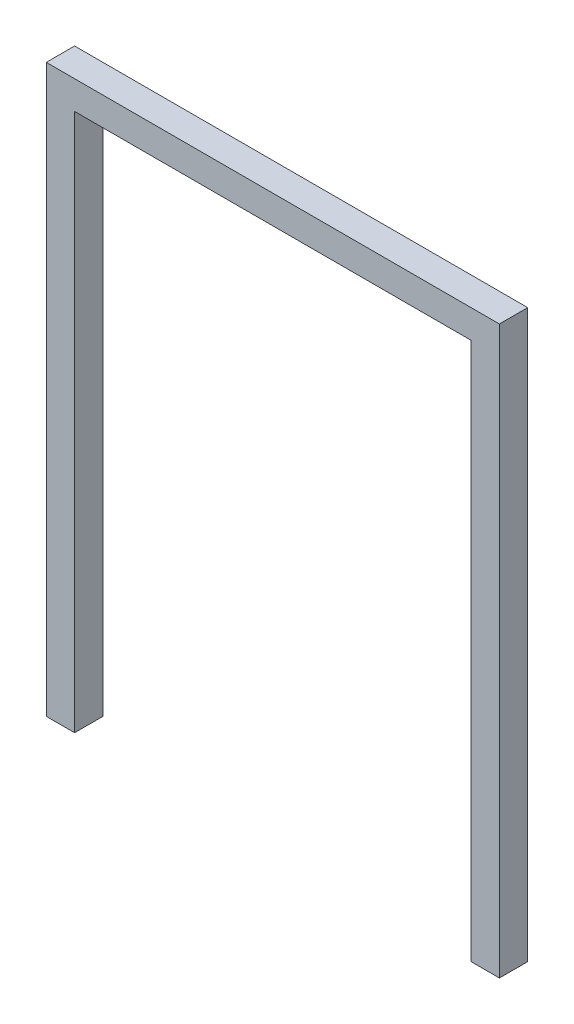
ISO-10303-21;
HEADER;
FILE_DESCRIPTION(('STEP AP214'),'2;1');
FILE_NAME('part.step','',(''),(''),'','','');
FILE_SCHEMA(('AUTOMOTIVE_DESIGN { 1 0 10303 214 1 1 1 1 }'));
ENDSEC;
DATA;
#1=APPLICATION_CONTEXT('core data for automotive mechanical design processes');
#2=APPLICATION_PROTOCOL_DEFINITION('international standard','automotive_design',2000,#1);
#3=PRODUCT_CONTEXT('',#1,'mechanical');
#4=PRODUCT('Part','Part','',(#3));
#5=PRODUCT_RELATED_PRODUCT_CATEGORY('part','',(#4));
#6=PRODUCT_DEFINITION_FORMATION('','',#4);
#7=PRODUCT_DEFINITION_CONTEXT('part definition',#1,'design');
#8=PRODUCT_DEFINITION('design','',#6,#7);
#9=PRODUCT_DEFINITION_SHAPE('','',#8);
#10=(LENGTH_UNIT() NAMED_UNIT(*) SI_UNIT(.MILLI.,.METRE.));
#11=(NAMED_UNIT(*) PLANE_ANGLE_UNIT() SI_UNIT($,.RADIAN.));
#12=(NAMED_UNIT(*) SI_UNIT($,.STERADIAN.) SOLID_ANGLE_UNIT());
#13=UNCERTAINTY_MEASURE_WITH_UNIT(LENGTH_MEASURE(1.E-05),#10,'distance_accuracy_value','');
#14=(GEOMETRIC_REPRESENTATION_CONTEXT(3) GLOBAL_UNCERTAINTY_ASSIGNED_CONTEXT((#13)) GLOBAL_UNIT_ASSIGNED_CONTEXT((#10,
#11,#12)) REPRESENTATION_CONTEXT('',''));
#15=CARTESIAN_POINT('',(0.,0.,0.));
#16=DIRECTION('',(0.,0.,1.));
#17=DIRECTION('',(1.,0.,0.));
#18=AXIS2_PLACEMENT_3D('',#15,#16,#17);
#19=CARTESIAN_POINT('',(0.,0.,25.4));
#20=DIRECTION('',(1.,0.,0.));
#21=DIRECTION('',(0.,0.,-1.));
#22=AXIS2_PLACEMENT_3D('',#19,#20,#21);
#23=PLANE('',#22);
#24=DIRECTION('',(0.,-1.,0.));
#25=VECTOR('',#24,1.);
#26=CARTESIAN_POINT('',(0.,0.,0.));
#27=LINE('',#26,#25);
#28=CARTESIAN_POINT('',(0.,508.,0.));
#29=VERTEX_POINT('',#28);
#30=CARTESIAN_POINT('',(0.,0.,0.));
#31=VERTEX_POINT('',#30);
#32=EDGE_CURVE('E129',#29,#31,#27,.T.);
#33=ORIENTED_EDGE('',*,*,#32,.T.);
#34=DIRECTION('',(0.,0.,-1.));
#35=VECTOR('',#34,1.);
#36=CARTESIAN_POINT('',(0.,0.,25.4));
#37=LINE('',#36,#35);
#38=CARTESIAN_POINT('',(0.,0.,25.4));
#39=VERTEX_POINT('',#38);
#40=EDGE_CURVE('E11',#39,#31,#37,.T.);
#41=ORIENTED_EDGE('',*,*,#40,.F.);
#42=DIRECTION('',(0.,-1.,0.));
#43=VECTOR('',#42,1.);
#44=CARTESIAN_POINT('',(0.,0.,25.4));
#45=LINE('',#44,#43);
#46=CARTESIAN_POINT('',(0.,508.,25.4));
#47=VERTEX_POINT('',#46);
#48=EDGE_CURVE('E145',#47,#39,#45,.T.);
#49=ORIENTED_EDGE('',*,*,#48,.F.);
#50=DIRECTION('',(0.,0.,-1.));
#51=VECTOR('',#50,1.);
#52=CARTESIAN_POINT('',(0.,508.,25.4));
#53=LINE('',#52,#51);
#54=EDGE_CURVE('E125',#47,#29,#53,.T.);
#55=ORIENTED_EDGE('',*,*,#54,.T.);
#56=EDGE_LOOP('',(#33,#41,#49,#55));
#57=FACE_BOUND('',#56,.T.);
#58=ADVANCED_FACE('F33',(#57),#23,.F.);
#59=CARTESIAN_POINT('',(0.,0.,25.4));
#60=DIRECTION('',(0.,1.,0.));
#61=DIRECTION('',(0.,0.,1.));
#62=AXIS2_PLACEMENT_3D('',#59,#60,#61);
#63=PLANE('',#62);
#64=DIRECTION('',(1.,0.,0.));
#65=VECTOR('',#64,1.);
#66=CARTESIAN_POINT('',(0.,0.,0.));
#67=LINE('',#66,#65);
#68=CARTESIAN_POINT('',(25.4,0.,0.));
#69=VERTEX_POINT('',#68);
#70=EDGE_CURVE('E132',#31,#69,#67,.T.);
#71=ORIENTED_EDGE('',*,*,#70,.T.);
#72=DIRECTION('',(0.,0.,-1.));
#73=VECTOR('',#72,1.);
#74=CARTESIAN_POINT('',(25.4,0.,25.4));
#75=LINE('',#74,#73);
#76=CARTESIAN_POINT('',(25.4,0.,25.4));
#77=VERTEX_POINT('',#76);
#78=EDGE_CURVE('E41',#77,#69,#75,.T.);
#79=ORIENTED_EDGE('',*,*,#78,.F.);
#80=DIRECTION('',(1.,0.,0.));
#81=VECTOR('',#80,1.);
#82=CARTESIAN_POINT('',(0.,0.,25.4));
#83=LINE('',#82,#81);
#84=EDGE_CURVE('E92',#39,#77,#83,.T.);
#85=ORIENTED_EDGE('',*,*,#84,.F.);
#86=ORIENTED_EDGE('',*,*,#40,.T.);
#87=EDGE_LOOP('',(#71,#79,#85,#86));
#88=FACE_BOUND('',#87,.T.);
#89=ADVANCED_FACE('F160',(#88),#63,.F.);
#90=CARTESIAN_POINT('',(25.4,25.4,25.4));
#91=DIRECTION('',(-1.,0.,0.));
#92=DIRECTION('',(0.,0.,1.));
#93=AXIS2_PLACEMENT_3D('',#90,#91,#92);
#94=PLANE('',#93);
#95=DIRECTION('',(0.,1.,0.));
#96=VECTOR('',#95,1.);
#97=CARTESIAN_POINT('',(25.4,25.4,0.));
#98=LINE('',#97,#96);
#99=CARTESIAN_POINT('',(25.4,482.6,0.));
#100=VERTEX_POINT('',#99);
#101=EDGE_CURVE('E135',#69,#100,#98,.T.);
#102=ORIENTED_EDGE('',*,*,#101,.T.);
#103=DIRECTION('',(0.,0.,-1.));
#104=VECTOR('',#103,1.);
#105=CARTESIAN_POINT('',(25.4,482.6,25.4));
#106=LINE('',#105,#104);
#107=CARTESIAN_POINT('',(25.4,482.6,25.4));
#108=VERTEX_POINT('',#107);
#109=EDGE_CURVE('E152',#108,#100,#106,.T.);
#110=ORIENTED_EDGE('',*,*,#109,.F.);
#111=DIRECTION('',(0.,1.,0.));
#112=VECTOR('',#111,1.);
#113=CARTESIAN_POINT('',(25.4,25.4,25.4));
#114=LINE('',#113,#112);
#115=EDGE_CURVE('E159',#77,#108,#114,.T.);
#116=ORIENTED_EDGE('',*,*,#115,.F.);
#117=ORIENTED_EDGE('',*,*,#78,.T.);
#118=EDGE_LOOP('',(#102,#110,#116,#117));
#119=FACE_BOUND('',#118,.T.);
#120=ADVANCED_FACE('F157',(#119),#94,.F.);
#121=CARTESIAN_POINT('',(25.4,482.6,25.4));
#122=DIRECTION('',(0.,1.,0.));
#123=DIRECTION('',(0.,0.,1.));
#124=AXIS2_PLACEMENT_3D('',#121,#122,#123);
#125=PLANE('',#124);
#126=DIRECTION('',(1.,0.,0.));
#127=VECTOR('',#126,1.);
#128=CARTESIAN_POINT('',(25.4,482.6,0.));
#129=LINE('',#128,#127);
#130=CARTESIAN_POINT('',(381.,482.6,0.));
#131=VERTEX_POINT('',#130);
#132=EDGE_CURVE('E137',#100,#131,#129,.T.);
#133=ORIENTED_EDGE('',*,*,#132,.T.);
#134=DIRECTION('',(0.,0.,-1.));
#135=VECTOR('',#134,1.);
#136=CARTESIAN_POINT('',(381.,482.6,25.4));
#137=LINE('',#136,#135);
#138=CARTESIAN_POINT('',(381.,482.6,25.4));
#139=VERTEX_POINT('',#138);
#140=EDGE_CURVE('E149',#139,#131,#137,.T.);
#141=ORIENTED_EDGE('',*,*,#140,.F.);
#142=DIRECTION('',(1.,0.,0.));
#143=VECTOR('',#142,1.);
#144=CARTESIAN_POINT('',(25.4,482.6,25.4));
#145=LINE('',#144,#143);
#146=EDGE_CURVE('E172',#108,#139,#145,.T.);
#147=ORIENTED_EDGE('',*,*,#146,.F.);
#148=ORIENTED_EDGE('',*,*,#109,.T.);
#149=EDGE_LOOP('',(#133,#141,#147,#148));
#150=FACE_BOUND('',#149,.T.);
#151=ADVANCED_FACE('F168',(#150),#125,.F.);
#152=CARTESIAN_POINT('',(381.,25.4,25.4));
#153=DIRECTION('',(1.,0.,0.));
#154=DIRECTION('',(0.,0.,-1.));
#155=AXIS2_PLACEMENT_3D('',#152,#153,#154);
#156=PLANE('',#155);
#157=DIRECTION('',(0.,-1.,0.));
#158=VECTOR('',#157,1.);
#159=CARTESIAN_POINT('',(381.,25.4,0.));
#160=LINE('',#159,#158);
#161=CARTESIAN_POINT('',(381.,0.,0.));
#162=VERTEX_POINT('',#161);
#163=EDGE_CURVE('E140',#131,#162,#160,.T.);
#164=ORIENTED_EDGE('',*,*,#163,.T.);
#165=DIRECTION('',(0.,0.,-1.));
#166=VECTOR('',#165,1.);
#167=CARTESIAN_POINT('',(381.,0.,25.4));
#168=LINE('',#167,#166);
#169=CARTESIAN_POINT('',(381.,0.,25.4));
#170=VERTEX_POINT('',#169);
#171=EDGE_CURVE('E120',#170,#162,#168,.T.);
#172=ORIENTED_EDGE('',*,*,#171,.F.);
#173=DIRECTION('',(0.,-1.,0.));
#174=VECTOR('',#173,1.);
#175=CARTESIAN_POINT('',(381.,25.4,25.4));
#176=LINE('',#175,#174);
#177=EDGE_CURVE('E111',#139,#170,#176,.T.);
#178=ORIENTED_EDGE('',*,*,#177,.F.);
#179=ORIENTED_EDGE('',*,*,#140,.T.);
#180=EDGE_LOOP('',(#164,#172,#178,#179));
#181=FACE_BOUND('',#180,.T.);
#182=ADVANCED_FACE('F171',(#181),#156,.F.);
#183=CARTESIAN_POINT('',(381.,0.,25.4));
#184=DIRECTION('',(0.,1.,0.));
#185=DIRECTION('',(0.,0.,1.));
#186=AXIS2_PLACEMENT_3D('',#183,#184,#185);
#187=PLANE('',#186);
#188=DIRECTION('',(1.,0.,0.));
#189=VECTOR('',#188,1.);
#190=CARTESIAN_POINT('',(381.,0.,0.));
#191=LINE('',#190,#189);
#192=CARTESIAN_POINT('',(406.4,0.,0.));
#193=VERTEX_POINT('',#192);
#194=EDGE_CURVE('E119',#162,#193,#191,.T.);
#195=ORIENTED_EDGE('',*,*,#194,.T.);
#196=DIRECTION('',(0.,0.,-1.));
#197=VECTOR('',#196,1.);
#198=CARTESIAN_POINT('',(406.4,0.,25.4));
#199=LINE('',#198,#197);
#200=CARTESIAN_POINT('',(406.4,0.,25.4));
#201=VERTEX_POINT('',#200);
#202=EDGE_CURVE('E116',#201,#193,#199,.T.);
#203=ORIENTED_EDGE('',*,*,#202,.F.);
#204=DIRECTION('',(1.,0.,0.));
#205=VECTOR('',#204,1.);
#206=CARTESIAN_POINT('',(381.,0.,25.4));
#207=LINE('',#206,#205);
#208=EDGE_CURVE('E105',#170,#201,#207,.T.);
#209=ORIENTED_EDGE('',*,*,#208,.F.);
#210=ORIENTED_EDGE('',*,*,#171,.T.);
#211=EDGE_LOOP('',(#195,#203,#209,#210));
#212=FACE_BOUND('',#211,.T.);
#213=ADVANCED_FACE('F117',(#212),#187,.F.);
#214=CARTESIAN_POINT('',(406.4,0.,25.4));
#215=DIRECTION('',(-1.,0.,0.));
#216=DIRECTION('',(0.,0.,1.));
#217=AXIS2_PLACEMENT_3D('',#214,#215,#216);
#218=PLANE('',#217);
#219=DIRECTION('',(0.,1.,0.));
#220=VECTOR('',#219,1.);
#221=CARTESIAN_POINT('',(406.4,0.,0.));
#222=LINE('',#221,#220);
#223=CARTESIAN_POINT('',(406.4,508.,0.));
#224=VERTEX_POINT('',#223);
#225=EDGE_CURVE('E78',#193,#224,#222,.T.);
#226=ORIENTED_EDGE('',*,*,#225,.T.);
#227=DIRECTION('',(0.,0.,-1.));
#228=VECTOR('',#227,1.);
#229=CARTESIAN_POINT('',(406.4,508.,25.4));
#230=LINE('',#229,#228);
#231=CARTESIAN_POINT('',(406.4,508.,25.4));
#232=VERTEX_POINT('',#231);
#233=EDGE_CURVE('E121',#232,#224,#230,.T.);
#234=ORIENTED_EDGE('',*,*,#233,.F.);
#235=DIRECTION('',(0.,1.,0.));
#236=VECTOR('',#235,1.);
#237=CARTESIAN_POINT('',(406.4,0.,25.4));
#238=LINE('',#237,#236);
#239=EDGE_CURVE('E109',#201,#232,#238,.T.);
#240=ORIENTED_EDGE('',*,*,#239,.F.);
#241=ORIENTED_EDGE('',*,*,#202,.T.);
#242=EDGE_LOOP('',(#226,#234,#240,#241));
#243=FACE_BOUND('',#242,.T.);
#244=ADVANCED_FACE('F123',(#243),#218,.F.);
#245=CARTESIAN_POINT('',(0.,508.,25.4));
#246=DIRECTION('',(0.,-1.,0.));
#247=DIRECTION('',(0.,0.,-1.));
#248=AXIS2_PLACEMENT_3D('',#245,#246,#247);
#249=PLANE('',#248);
#250=DIRECTION('',(-1.,0.,0.));
#251=VECTOR('',#250,1.);
#252=CARTESIAN_POINT('',(0.,508.,0.));
#253=LINE('',#252,#251);
#254=EDGE_CURVE('E84',#224,#29,#253,.T.);
#255=ORIENTED_EDGE('',*,*,#254,.T.);
#256=ORIENTED_EDGE('',*,*,#54,.F.);
#257=DIRECTION('',(-1.,0.,0.));
#258=VECTOR('',#257,1.);
#259=CARTESIAN_POINT('',(0.,508.,25.4));
#260=LINE('',#259,#258);
#261=EDGE_CURVE('E49',#232,#47,#260,.T.);
#262=ORIENTED_EDGE('',*,*,#261,.F.);
#263=ORIENTED_EDGE('',*,*,#233,.T.);
#264=EDGE_LOOP('',(#255,#256,#262,#263));
#265=FACE_BOUND('',#264,.T.);
#266=ADVANCED_FACE('F179',(#265),#249,.F.);
#267=CARTESIAN_POINT('',(0.,0.,25.4));
#268=DIRECTION('',(0.,0.,-1.));
#269=DIRECTION('',(-1.,0.,0.));
#270=AXIS2_PLACEMENT_3D('',#267,#268,#269);
#271=PLANE('',#270);
#272=ORIENTED_EDGE('',*,*,#48,.T.);
#273=ORIENTED_EDGE('',*,*,#84,.T.);
#274=ORIENTED_EDGE('',*,*,#115,.T.);
#275=ORIENTED_EDGE('',*,*,#146,.T.);
#276=ORIENTED_EDGE('',*,*,#177,.T.);
#277=ORIENTED_EDGE('',*,*,#208,.T.);
#278=ORIENTED_EDGE('',*,*,#239,.T.);
#279=ORIENTED_EDGE('',*,*,#261,.T.);
#280=EDGE_LOOP('',(#272,#273,#274,#275,#276,#277,#278,#279));
#281=FACE_BOUND('',#280,.T.);
#282=ADVANCED_FACE('F107',(#281),#271,.F.);
#283=CARTESIAN_POINT('',(0.,0.,0.));
#284=DIRECTION('',(0.,0.,-1.));
#285=DIRECTION('',(-1.,0.,0.));
#286=AXIS2_PLACEMENT_3D('',#283,#284,#285);
#287=PLANE('',#286);
#288=ORIENTED_EDGE('',*,*,#32,.F.);
#289=ORIENTED_EDGE('',*,*,#254,.F.);
#290=ORIENTED_EDGE('',*,*,#225,.F.);
#291=ORIENTED_EDGE('',*,*,#194,.F.);
#292=ORIENTED_EDGE('',*,*,#163,.F.);
#293=ORIENTED_EDGE('',*,*,#132,.F.);
#294=ORIENTED_EDGE('',*,*,#101,.F.);
#295=ORIENTED_EDGE('',*,*,#70,.F.);
#296=EDGE_LOOP('',(#288,#289,#290,#291,#292,#293,#294,#295));
#297=FACE_BOUND('',#296,.T.);
#298=ADVANCED_FACE('F164',(#297),#287,.T.);
#299=CLOSED_SHELL('',(#58,#89,#120,#151,#182,#213,#244,#266,#282,#298));
#300=MANIFOLD_SOLID_BREP('B2',#299);
#301=ADVANCED_BREP_SHAPE_REPRESENTATION('',(#18,#300),#14);
#302=SHAPE_DEFINITION_REPRESENTATION(#9,#301);
ENDSEC;
END-ISO-10303-21;
